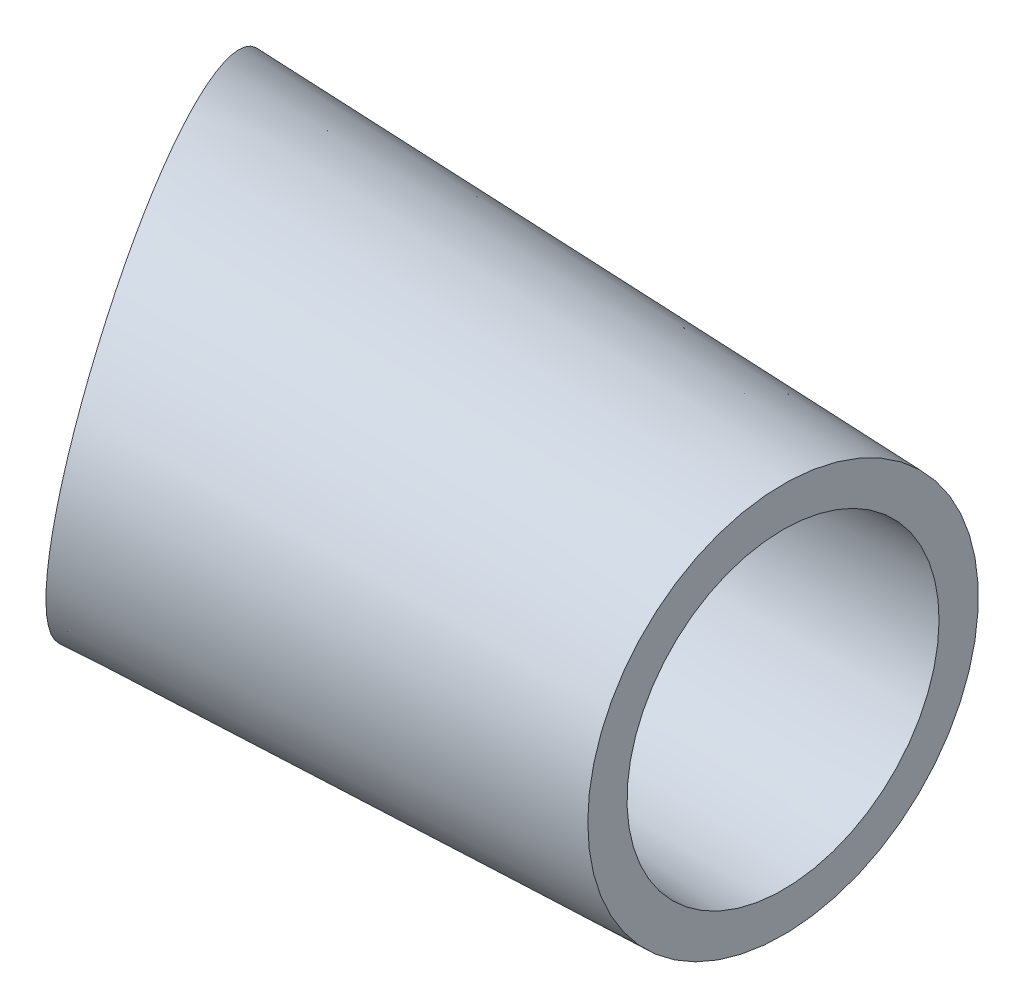
ISO-10303-21;
HEADER;
FILE_DESCRIPTION(('STEP AP214'),'2;1');
FILE_NAME('part.step','',(''),(''),'','','');
FILE_SCHEMA(('AUTOMOTIVE_DESIGN { 1 0 10303 214 1 1 1 1 }'));
ENDSEC;
DATA;
#1=APPLICATION_CONTEXT('core data for automotive mechanical design processes');
#2=APPLICATION_PROTOCOL_DEFINITION('international standard','automotive_design',2000,#1);
#3=PRODUCT_CONTEXT('',#1,'mechanical');
#4=PRODUCT('Part','Part','',(#3));
#5=PRODUCT_RELATED_PRODUCT_CATEGORY('part','',(#4));
#6=PRODUCT_DEFINITION_FORMATION('','',#4);
#7=PRODUCT_DEFINITION_CONTEXT('part definition',#1,'design');
#8=PRODUCT_DEFINITION('design','',#6,#7);
#9=PRODUCT_DEFINITION_SHAPE('','',#8);
#10=(LENGTH_UNIT() NAMED_UNIT(*) SI_UNIT(.MILLI.,.METRE.));
#11=(NAMED_UNIT(*) PLANE_ANGLE_UNIT() SI_UNIT($,.RADIAN.));
#12=(NAMED_UNIT(*) SI_UNIT($,.STERADIAN.) SOLID_ANGLE_UNIT());
#13=UNCERTAINTY_MEASURE_WITH_UNIT(LENGTH_MEASURE(1.E-05),#10,'distance_accuracy_value','');
#14=(GEOMETRIC_REPRESENTATION_CONTEXT(3) GLOBAL_UNCERTAINTY_ASSIGNED_CONTEXT((#13)) GLOBAL_UNIT_ASSIGNED_CONTEXT((#10,
#11,#12)) REPRESENTATION_CONTEXT('',''));
#15=CARTESIAN_POINT('',(0.,0.,0.));
#16=DIRECTION('',(0.,0.,1.));
#17=DIRECTION('',(1.,0.,0.));
#18=AXIS2_PLACEMENT_3D('',#15,#16,#17);
#19=CARTESIAN_POINT('',(-3.32033784135941,95.7593495012203,-0.184037288881903));
#20=CARTESIAN_POINT('',(-3.32023972351497,95.760214114572,-0.122691525921269));
#21=CARTESIAN_POINT('',(-3.32014160567053,95.7610787279237,-0.0613457629606337));
#22=CARTESIAN_POINT('',(-3.31023170338174,95.8484046764461,6.13457629606349));
#23=CARTESIAN_POINT('',(-2.47661605890323,95.9749337579072,9.08435945500562));
#24=CARTESIAN_POINT('',(4.26277069198733E-12,96.1037825269542,10.0000000001944));
#25=CARTESIAN_POINT('',(-3.31685623577,95.5062330008136,-0.183936354268494));
#26=CARTESIAN_POINT('',(-3.3167908238737,95.5068094097147,-0.122624236178996));
#27=CARTESIAN_POINT('',(-3.3167254119774,95.5073858186158,-0.0613121180894974));
#28=CARTESIAN_POINT('',(-3.31011881045102,95.5656031176307,6.13121180894982));
#29=CARTESIAN_POINT('',(-2.47138663452059,95.6499558386048,9.09100481577225));
#30=CARTESIAN_POINT('',(4.26287477539589E-12,95.7358550179695,10.0000000001296));
#31=CARTESIAN_POINT('',(-3.31337463018059,95.2531165004068,-0.183835419655084));
#32=CARTESIAN_POINT('',(-3.31334192423243,95.2534047048574,-0.122556946436723));
#33=CARTESIAN_POINT('',(-3.31330921828427,95.2536929093079,-0.0612784732183612));
#34=CARTESIAN_POINT('',(-3.31000591752029,95.2828015588154,6.12784732183616));
#35=CARTESIAN_POINT('',(-2.46615721013795,95.3249779193024,9.09765017653888));
#36=CARTESIAN_POINT('',(4.26297885880444E-12,95.3679275089847,10.0000000000649));
#37=CARTESIAN_POINT('',(-3.29901300712426,94.2090109362289,-0.18341906437477));
#38=CARTESIAN_POINT('',(-3.29911521321219,94.2081102973209,-0.122279376249847));
#39=CARTESIAN_POINT('',(-3.29921741930012,94.2072096584129,-0.0611396881249241));
#40=CARTESIAN_POINT('',(-3.30954023418106,94.1162451287022,6.11396881249228));
#41=CARTESIAN_POINT('',(-2.44458583455956,93.98444400218,9.12506228970122));
#42=CARTESIAN_POINT('',(4.26340820286475E-12,93.8502265344227,9.99999999979762));
#43=CARTESIAN_POINT('',(-3.29768877126216,92.6266734184361,-0.186237597628298));
#44=CARTESIAN_POINT('',(-3.29792020399182,92.6239932699078,-0.124158398418865));
#45=CARTESIAN_POINT('',(-3.29815163672148,92.6213131213796,-0.0620791992094317));
#46=CARTESIAN_POINT('',(-3.32152634241694,92.3506181200275,6.20791992094334));
#47=CARTESIAN_POINT('',(-2.41952482664806,91.957927997574,9.36453261538096));
#48=CARTESIAN_POINT('',(4.26316425737594E-12,91.5582050316754,10.313090735642));
#49=CARTESIAN_POINT('',(-3.35957448772953,90.2525842129129,-0.196425885249977));
#50=CARTESIAN_POINT('',(-3.35976510287447,90.2477072970523,-0.130950590166652));
#51=CARTESIAN_POINT('',(-3.35995571801942,90.2428303811917,-0.0654752950833268));
#52=CARTESIAN_POINT('',(-3.37920784765884,89.7502618792728,6.54752950833252));
#53=CARTESIAN_POINT('',(-2.40569252875286,89.0037801383462,10.065051511361));
#54=CARTESIAN_POINT('',(4.26327267759319E-12,88.2551653725644,11.3232146909706));
#55=CARTESIAN_POINT('',(-3.48789694750273,87.8798833437328,-0.210046179333926));
#56=CARTESIAN_POINT('',(-3.48780298657084,87.8731973423953,-0.140030786222618));
#57=CARTESIAN_POINT('',(-3.48770902563896,87.8665113410579,-0.0700153931113102));
#58=CARTESIAN_POINT('',(-3.47821897151817,87.1912252059778,7.0015393111308));
#59=CARTESIAN_POINT('',(-2.41650997536182,86.122113444057,10.9614290022923));
#60=CARTESIAN_POINT('',(4.26335399275612E-12,85.0653506856381,12.6440562080894));
#61=CARTESIAN_POINT('',(-3.7493170802311,84.7211682382065,-0.231093606619197));
#62=CARTESIAN_POINT('',(-3.74851262567534,84.7124685048417,-0.154062404412798));
#63=CARTESIAN_POINT('',(-3.74770817111957,84.7037687714769,-0.0770312022063989));
#64=CARTESIAN_POINT('',(-3.66645826098768,83.8250957016303,7.7031202206399));
#65=CARTESIAN_POINT('',(-2.46437823144004,82.3584566862005,12.3206657414968));
#66=CARTESIAN_POINT('',(4.26178189960602E-12,80.9331141395866,14.6660474659493));
#67=CARTESIAN_POINT('',(-4.14883428544006,81.5743967974306,-0.254913355292645));
#68=CARTESIAN_POINT('',(-4.14681367768039,81.5640823883875,-0.169942236861764));
#69=CARTESIAN_POINT('',(-4.14479306992071,81.5537679793444,-0.0849711184308833));
#70=CARTESIAN_POINT('',(-3.94071168619355,80.5120126659906,8.49711184308807));
#71=CARTESIAN_POINT('',(-2.56328198030883,78.6819541971733,13.8365350812361));
#72=CARTESIAN_POINT('',(4.26243242090951E-12,76.9313242773252,16.9378684683057));
#73=CARTESIAN_POINT('',(-4.68295707642726,78.4478025029072,-0.280054343935183));
#74=CARTESIAN_POINT('',(-4.67922812087052,78.4360394499658,-0.186702895956789));
#75=CARTESIAN_POINT('',(-4.67549916531377,78.4242763970243,-0.0933514479783945));
#76=CARTESIAN_POINT('',(-4.29887465408258,77.2362080499361,9.3351447978394));
#77=CARTESIAN_POINT('',(-2.71179646748194,75.0590430997608,15.4259875601082));
#78=CARTESIAN_POINT('',(4.26210716025777E-12,73.00255130138,19.3279693012835));
#79=CARTESIAN_POINT('',(-5.14673963594628,76.1140332129099,-0.299501106901493));
#80=CARTESIAN_POINT('',(-5.14149843725689,76.1012474988851,-0.199667404600996));
#81=CARTESIAN_POINT('',(-5.1362572385675,76.0884617848602,-0.0998337023004997));
#82=CARTESIAN_POINT('',(-4.60689617093905,74.797104668346,9.98337023004968));
#83=CARTESIAN_POINT('',(-2.84645663689108,72.3661585156109,16.6509857151081));
#84=CARTESIAN_POINT('',(4.26145663895428E-12,70.087922534884,21.1734493496429));
#85=CARTESIAN_POINT('',(-5.66960033513341,73.7926606125094,-0.319207371721182));
#86=CARTESIAN_POINT('',(-5.66263102603827,73.7788527315476,-0.212804914480788));
#87=CARTESIAN_POINT('',(-5.65566171694312,73.7650448505858,-0.106402457240395));
#88=CARTESIAN_POINT('',(-4.95176149833334,72.3704488734477,10.6402457240393));
#89=CARTESIAN_POINT('',(-3.00286004520668,69.6874526294797,17.8899295846978));
#90=CARTESIAN_POINT('',(4.26232400069226E-12,67.1886508077457,23.0417873180457));
#91=CARTESIAN_POINT('',(-6.43525565785067,70.7137830284242,-0.344992255778418));
#92=CARTESIAN_POINT('',(-6.42573186793471,70.6984333356769,-0.229994837185612));
#93=CARTESIAN_POINT('',(-6.41620807801876,70.6830836429297,-0.114997418592806));
#94=CARTESIAN_POINT('',(-5.45430529650727,69.1327646754583,11.4997418592806));
#95=CARTESIAN_POINT('',(-3.23661388113566,66.102666797379,19.5124736250272));
#96=CARTESIAN_POINT('',(4.26221558047502E-12,63.2932020151346,25.4874914676674));
#97=CARTESIAN_POINT('',(-7.50153342633092,66.8952690777941,-0.374524402186752));
#98=CARTESIAN_POINT('',(-7.48841745252247,66.8773190281757,-0.249682934791168));
#99=CARTESIAN_POINT('',(-7.47530147871403,66.8593689785573,-0.124841467395585));
#100=CARTESIAN_POINT('',(-6.15058812406101,65.0464139670973,12.4841467395583));
#101=CARTESIAN_POINT('',(-3.56900792193635,61.5366653409081,21.3833928959682));
#102=CARTESIAN_POINT('',(4.26178189960602E-12,58.2736793816245,28.2978871058391));
#103=CARTESIAN_POINT('',(-8.86363666274132,62.3401215379093,-0.404558842889708));
#104=CARTESIAN_POINT('',(-8.84590739735435,62.3180160374998,-0.269705895259806));
#105=CARTESIAN_POINT('',(-8.82817813196738,62.2959105370903,-0.134852947629903));
#106=CARTESIAN_POINT('',(-7.03752232788325,60.0632549957304,13.4852947629902));
#107=CARTESIAN_POINT('',(-3.99846088484188,55.9060414516423,23.3153582527551));
#108=CARTESIAN_POINT('',(4.26221558047502E-12,51.9975856787107,31.1776105577497));
#109=CARTESIAN_POINT('',(-9.97919300632939,58.540308371435,-0.424046298602275));
#110=CARTESIAN_POINT('',(-9.95768882408465,58.5139999864224,-0.282697532401517));
#111=CARTESIAN_POINT('',(-9.93618464183992,58.4876916014099,-0.141348766200758));
#112=CARTESIAN_POINT('',(-7.76426223512187,55.8305447151425,14.1348766200758));
#113=CARTESIAN_POINT('',(-4.3495195011584,51.0813708850248,24.6054585942461));
#114=CARTESIAN_POINT('',(4.26069769743354E-12,46.5619634785758,33.0730196024647));
#115=CARTESIAN_POINT('',(-10.7689861497816,55.4735899432799,-0.435382914505368));
#116=CARTESIAN_POINT('',(-10.744834329219,55.4436077109046,-0.290255276336913));
#117=CARTESIAN_POINT('',(-10.7206825086564,55.4136254785292,-0.145127638168459));
#118=CARTESIAN_POINT('',(-8.28134863183441,52.385420008619,14.5127638168454));
#119=CARTESIAN_POINT('',(-4.59313687737679,47.1400205183786,25.3926490957045));
#120=CARTESIAN_POINT('',(4.26069769743354E-12,42.1006978370791,34.2026787776034));
#121=CARTESIAN_POINT('',(-11.4551823114214,52.3830961194043,-0.443476779985051));
#122=CARTESIAN_POINT('',(-11.4287588425784,52.3492982635544,-0.295651186656701));
#123=CARTESIAN_POINT('',(-11.4023353737355,52.3155004077046,-0.147825593328351));
#124=CARTESIAN_POINT('',(-8.73356502059806,48.9019169668697,14.782559332835));
#125=CARTESIAN_POINT('',(-4.79912916457822,43.1496982976652,25.9933016684416));
#126=CARTESIAN_POINT('',(4.26091453786803E-12,37.5760945758979,35.0376646526285));
#127=CARTESIAN_POINT('',(-12.1055081178511,48.4791458825052,-0.446750483580614));
#128=CARTESIAN_POINT('',(-12.07699835425,48.4403828032049,-0.29783365572041));
#129=CARTESIAN_POINT('',(-12.0484885906488,48.4016197239047,-0.148916827860206));
#130=CARTESIAN_POINT('',(-9.16900246693089,44.4865487145831,14.8916827860204));
#131=CARTESIAN_POINT('',(-4.98119514461128,38.0855142895933,26.3507123663262));
#132=CARTESIAN_POINT('',(4.26134821873703E-12,31.8237842773403,35.459707196775));
#133=CARTESIAN_POINT('',(-12.5360213231124,43.7497341824,-0.436876927798753));
#134=CARTESIAN_POINT('',(-12.5062801413744,43.7052317407423,-0.291251285199171));
#135=CARTESIAN_POINT('',(-12.4765389596364,43.6607292990847,-0.145625642599588));
#136=CARTESIAN_POINT('',(-9.47267960409738,39.1659826916659,14.5625642599583));
#137=CARTESIAN_POINT('',(-5.07214774015747,31.9988994335269,25.9869351945906));
#138=CARTESIAN_POINT('',(4.25961349526105E-12,24.931050597628,34.7128972833208));
#139=CARTESIAN_POINT('',(-12.6212935934464,38.9985715914568,-0.41102705648737));
#140=CARTESIAN_POINT('',(-12.5915779167477,38.9495517914533,-0.274018037658249));
#141=CARTESIAN_POINT('',(-12.561862240049,38.9005319914499,-0.137009018829127));
#142=CARTESIAN_POINT('',(-9.56057889347722,33.9495321911022,13.7009018829121));
#143=CARTESIAN_POINT('',(-5.03693848330505,26.1001875986502,24.7062954566062));
#144=CARTESIAN_POINT('',(4.26091453786803E-12,18.3450335602116,32.5158945216112));
#145=CARTESIAN_POINT('',(-12.3841419226867,34.2455000702239,-0.369503390993638));
#146=CARTESIAN_POINT('',(-12.3556275264852,34.1944133754301,-0.246335593995761));
#147=CARTESIAN_POINT('',(-12.3271131302838,34.1433266806363,-0.123167796997883));
#148=CARTESIAN_POINT('',(-9.4471591139335,28.9835705064628,12.3167796997878));
#149=CARTESIAN_POINT('',(-4.88352563427438,20.6233994174228,22.5272063493302));
#150=CARTESIAN_POINT('',(4.26048085699904E-12,12.4214708252582,28.8969340098351));
#151=CARTESIAN_POINT('',(-11.8581845778124,29.5059742198807,-0.315411089303516));
#152=CARTESIAN_POINT('',(-11.8319269160911,29.4560307106992,-0.210274059535679));
#153=CARTESIAN_POINT('',(-11.8056692543698,29.4060872015178,-0.105137029767843));
#154=CARTESIAN_POINT('',(-9.15364542051688,24.3617927741863,10.5137029767837));
#155=CARTESIAN_POINT('',(-4.62378482897337,15.7157797145001,19.6294449974072));
#156=CARTESIAN_POINT('',(4.26004717613004E-12,7.38243997545722,24.1390359951614));
#157=CARTESIAN_POINT('',(-11.0806195731737,24.7911792432987,-0.252644900952354));
#158=CARTESIAN_POINT('',(-11.0575407955123,24.7456044231843,-0.168429933968238));
#159=CARTESIAN_POINT('',(-11.0344620178509,24.7000296030698,-0.0842149669841222));
#160=CARTESIAN_POINT('',(-8.70350547404954,20.0969727715102,8.42149669841161));
#161=CARTESIAN_POINT('',(-4.27088999612501,11.3895287702404,16.238249857114));
#162=CARTESIAN_POINT('',(4.25874613352306E-12,3.24055466969312,18.5970017747044));
#163=CARTESIAN_POINT('',(-10.4185528817039,21.6691348919108,-0.207079090190809));
#164=CARTESIAN_POINT('',(-10.398121977882,21.6283569833582,-0.138052726793874));
#165=CARTESIAN_POINT('',(-10.3776910740601,21.5875790748056,-0.0690263633969403));
#166=CARTESIAN_POINT('',(-8.31416978805036,17.4690103109952,6.90263633969341));
#167=CARTESIAN_POINT('',(-3.98203460682282,8.84975260740575,13.7678189913936));
#168=CARTESIAN_POINT('',(4.26048085699904E-12,1.00686582638344,14.5673986785919));
#169=CARTESIAN_POINT('',(-10.0569822278478,20.1139644556955,-0.183706863396939));
#170=CARTESIAN_POINT('',(-10.0379881518985,20.075976303797,-0.122471242264628));
#171=CARTESIAN_POINT('',(-10.0189940759493,20.0379881518985,-0.0612356211323165));
#172=CARTESIAN_POINT('',(-8.10059240507301,16.2011848101491,6.12356211323112));
#173=CARTESIAN_POINT('',(-3.82610913475955,7.65221826952447,12.5));
#174=CARTESIAN_POINT('',(4.25961349526105E-12,0.,12.5));
#175=B_SPLINE_SURFACE_WITH_KNOTS('',3,3,((#19,#20,#21,#22,#23,#24),(#25,#26,#27,#28,#29,#30),
(#31,#32,#33,#34,#35,#36),(#37,#38,#39,#40,#41,#42),(#43,#44,#45,#46,#47,#48),(#49,#50,#51,#52,
#53,#54),(#55,#56,#57,#58,#59,#60),(#61,#62,#63,#64,#65,#66),(#67,#68,#69,#70,#71,#72),(#73,#74,
#75,#76,#77,#78),(#79,#80,#81,#82,#83,#84),(#85,#86,#87,#88,#89,#90),(#91,#92,#93,#94,#95,#96),
(#97,#98,#99,#100,#101,#102),(#103,#104,#105,#106,#107,#108),(#109,#110,#111,#112,#113,#114),
(#115,#116,#117,#118,#119,#120),(#121,#122,#123,#124,#125,#126),(#127,#128,#129,#130,#131,#132),
(#133,#134,#135,#136,#137,#138),(#139,#140,#141,#142,#143,#144),(#145,#146,#147,#148,#149,#150),
(#151,#152,#153,#154,#155,#156),(#157,#158,#159,#160,#161,#162),(#163,#164,#165,#166,#167,#168),
(#169,#170,#171,#172,#173,#174)),.UNSPECIFIED.,.F.,.F.,.F.,(4,2,1,1,1,1,1,1,1,1,1,1,1,1,1,1,1,1,
1,1,1,1,4),(4,2,4),(-0.01,0.,0.03125,0.0625,0.09375,0.125,0.1875,0.21875,0.25,0.28125,0.3125,
0.375,0.4375,0.5,0.53125,0.5625,0.625,0.6875,0.75,0.8125,0.875,0.9375,1.),(-0.01,0.,1.),.UNSPECIFIED.);
#176=OFFSET_SURFACE('',#175,-1.,.F.);
#177=CARTESIAN_POINT('',(-1.34638529566944,44.3155755011315,29.1555116497258));
#178=CARTESIAN_POINT('',(-1.4465354121165,44.2007606660017,28.989581409363));
#179=CARTESIAN_POINT('',(-1.54904541566924,44.1044751743858,28.8117064586224));
#180=CARTESIAN_POINT('',(-1.7549039185898,43.9522667666393,28.4394100964137));
#181=CARTESIAN_POINT('',(-1.85825395525615,43.896456577443,28.2449441461297));
#182=CARTESIAN_POINT('',(-2.04872966671729,43.8324142734691,27.8731229791597));
#183=CARTESIAN_POINT('',(-2.13621166602821,43.8189209885129,27.6968493617625));
#184=CARTESIAN_POINT('',(-2.30653317435261,43.825857925678,27.3428780300895));
#185=CARTESIAN_POINT('',(-2.389377995579,43.846248473832,27.165182223413));
#186=CARTESIAN_POINT('',(-2.54560936306189,43.9206687195739,26.819118520454));
#187=CARTESIAN_POINT('',(-2.61920205631472,43.9736942175562,26.6506298998867));
#188=CARTESIAN_POINT('',(-2.75705841875894,44.1126197288856,26.3235639225748));
#189=CARTESIAN_POINT('',(-2.82132533004585,44.19850827949,26.1649831323569));
#190=CARTESIAN_POINT('',(-2.93241233972624,44.3927633461726,25.8781054161317));
#191=CARTESIAN_POINT('',(-2.98028495732457,44.4983925192077,25.7483666317751));
#192=CARTESIAN_POINT('',(-3.06376537529947,44.7336608905451,25.508131477087));
#193=CARTESIAN_POINT('',(-3.09938419064456,44.8632783636439,25.3976178696192));
#194=CARTESIAN_POINT('',(-3.15331264517634,45.1273743944897,25.2117826419738));
#195=CARTESIAN_POINT('',(-3.1730860997234,45.2597820595921,25.1339377558404));
#196=CARTESIAN_POINT('',(-3.2003527140644,45.5366457006801,25.0008207001009));
#197=CARTESIAN_POINT('',(-3.20785274466864,45.6810948880426,24.9455359141009));
#198=CARTESIAN_POINT('',(-3.21003229797414,45.9660234948866,24.8629185555983));
#199=CARTESIAN_POINT('',(-3.20563668847143,46.1059797367059,24.8337912791046));
#200=CARTESIAN_POINT('',(-3.18609346542773,46.3879423498395,24.7973325211571));
#201=CARTESIAN_POINT('',(-3.17094716138985,46.529948469402,24.789998385724));
#202=CARTESIAN_POINT('',(-3.13068242092791,46.8105328802122,24.7967870535172));
#203=CARTESIAN_POINT('',(-3.10566462109807,46.9491312143632,24.8106972639624));
#204=CARTESIAN_POINT('',(-3.04656946847162,47.2208262472084,24.8584420821187));
#205=CARTESIAN_POINT('',(-3.01249049381709,47.353921956056,24.8922802580511));
#206=CARTESIAN_POINT('',(-2.93430754084566,47.6186965301582,24.9805232640828));
#207=CARTESIAN_POINT('',(-2.88975808706411,47.7499020017963,25.0359493674181));
#208=CARTESIAN_POINT('',(-2.79323502230391,48.0002244838933,25.1646499263377));
#209=CARTESIAN_POINT('',(-2.74125876594073,48.1193371609979,25.2379307482573));
#210=CARTESIAN_POINT('',(-2.62589315700218,48.3544289781285,25.4077315330935));
#211=CARTESIAN_POINT('',(-2.5618855958766,48.4689798042125,25.5058174392502));
#212=CARTESIAN_POINT('',(-2.46179449516723,48.6266252347687,25.6641987264046));
#213=CARTESIAN_POINT('',(-2.42773713479154,48.6768266003087,25.7188907878474));
#214=CARTESIAN_POINT('',(-2.358419816383,48.7724123825925,25.8317050382074));
#215=CARTESIAN_POINT('',(-2.3231590015531,48.8177932687237,25.8898296933996));
#216=CARTESIAN_POINT('',(-2.20823580725342,48.9556024782042,26.0815136541586));
#217=CARTESIAN_POINT('',(-2.12660667107005,49.0383109611928,26.2210353654468));
#218=CARTESIAN_POINT('',(-1.96056091785451,49.1779165366318,26.5109443640531));
#219=CARTESIAN_POINT('',(-1.87614289230237,49.2348003658373,26.661337188791));
#220=CARTESIAN_POINT('',(-1.74551117682775,49.3018715263175,26.8984797845266));
#221=CARTESIAN_POINT('',(-1.69953133903523,49.3215103982203,26.9827864145765));
#222=CARTESIAN_POINT('',(-1.60771174314842,49.3528405834087,27.1528283670802));
#223=CARTESIAN_POINT('',(-1.56187189344877,49.3645394331215,27.2385622553919));
#224=CARTESIAN_POINT('',(-1.42492738368018,49.3875795022212,27.4972839782879));
#225=CARTESIAN_POINT('',(-1.33439482262334,49.3868657464839,27.6717972056511));
#226=CARTESIAN_POINT('',(-1.15639989747605,49.3520067899498,28.0227764078841));
#227=CARTESIAN_POINT('',(-1.06901088714405,49.317320981995,28.1992283059881));
#228=CARTESIAN_POINT('',(-0.94411531674211,49.239200408001,28.4588574902964));
#229=CARTESIAN_POINT('',(-0.903493534485064,49.2087869432743,28.5446062382591));
#230=CARTESIAN_POINT('',(-0.824790117935493,49.1392122640523,28.713664818325));
#231=CARTESIAN_POINT('',(-0.786707015616918,49.1000561630975,28.7969760440405));
#232=CARTESIAN_POINT('',(-0.716306818314014,49.0162482731223,28.9542609025851));
#233=CARTESIAN_POINT('',(-0.683771567504816,48.9722188769611,29.0284689613326));
#234=CARTESIAN_POINT('',(-0.621771639345025,48.87680253117,29.1732980543214));
#235=CARTESIAN_POINT('',(-0.59230505052331,48.8254202096184,29.2439213073145));
#236=CARTESIAN_POINT('',(-0.536890641475956,48.7155140659258,29.3807793975007));
#237=CARTESIAN_POINT('',(-0.510940259153804,48.6569955033529,29.4470174118192));
#238=CARTESIAN_POINT('',(-0.462978769442422,48.5331144887952,29.5743188100954));
#239=CARTESIAN_POINT('',(-0.440966914924745,48.4677533385684,29.6353831743213));
#240=CARTESIAN_POINT('',(-0.404052738719056,48.3402056355667,29.7434155282292));
#241=CARTESIAN_POINT('',(-0.388587495318023,48.2788404701855,29.7911631251661));
#242=CARTESIAN_POINT('',(-0.361112608278354,48.1518091329266,29.8816647292222));
#243=CARTESIAN_POINT('',(-0.349102410157967,48.0861436532623,29.9244195369524));
#244=CARTESIAN_POINT('',(-0.328729345890493,47.9510592476366,30.0044183662989));
#245=CARTESIAN_POINT('',(-0.320363988438825,47.8816429220286,30.0416661405161));
#246=CARTESIAN_POINT('',(-0.307396998311577,47.7396144666055,30.1102507812577));
#247=CARTESIAN_POINT('',(-0.302795036394146,47.6670026169376,30.14158816467));
#248=CARTESIAN_POINT('',(-0.297723816177089,47.5277250942955,30.1947665193406));
#249=CARTESIAN_POINT('',(-0.296841223376981,47.4613321860646,30.2172843444985));
#250=CARTESIAN_POINT('',(-0.298063613779162,47.3270564809849,30.2572454796125));
#251=CARTESIAN_POINT('',(-0.300169538654766,47.259173221167,30.2746871880116));
#252=CARTESIAN_POINT('',(-0.310914885138956,47.0541333239012,30.3191775821395));
#253=CARTESIAN_POINT('',(-0.32397608712901,46.9154214920074,30.3384543401841));
#254=CARTESIAN_POINT('',(-0.36068834125607,46.6410895712825,30.3558674107071));
#255=CARTESIAN_POINT('',(-0.384114219448028,46.5054650076653,30.3544337420244));
#256=CARTESIAN_POINT('',(-0.426198466196689,46.3048281282517,30.337862771329));
#257=CARTESIAN_POINT('',(-0.441389237781406,46.2383980014453,30.3299315498555));
#258=CARTESIAN_POINT('',(-0.473932170550685,46.1067524998502,30.3094176612601));
#259=CARTESIAN_POINT('',(-0.491285698880511,46.0415379236935,30.2968320419606));
#260=CARTESIAN_POINT('',(-0.548723897017184,45.8398649497262,30.2504095112224));
#261=CARTESIAN_POINT('',(-0.592339835050283,45.7061559825659,30.2086275601822));
#262=CARTESIAN_POINT('',(-0.686900384669092,45.4486844444275,30.1067097817484));
#263=CARTESIAN_POINT('',(-0.737850297105143,45.3249291695053,30.0465606433497));
#264=CARTESIAN_POINT('',(-0.821574284708666,45.141717992553,29.9404116934227));
#265=CARTESIAN_POINT('',(-0.852395364097462,45.0780744467928,29.8999566795068));
#266=CARTESIAN_POINT('',(-0.915528152249458,44.9548378871878,29.8144633570083));
#267=CARTESIAN_POINT('',(-0.947838568162507,44.8952414673119,29.7694289841484));
#268=CARTESIAN_POINT('',(-1.04664513655358,44.7229047960106,29.6280061460911));
#269=CARTESIAN_POINT('',(-1.11511275208752,44.6164083828587,29.5251757039736));
#270=CARTESIAN_POINT('',(-1.21163962857108,44.4826515486896,29.3739924210345));
#271=CARTESIAN_POINT('',(-1.23831030878563,44.4473480212629,29.3315930066486));
#272=CARTESIAN_POINT('',(-1.2920574821367,44.3794306322683,29.2449278964437));
#273=CARTESIAN_POINT('',(-1.31913402504033,44.3468171037912,29.2006619705252));
#274=CARTESIAN_POINT('',(-1.34638529566944,44.3155755011315,29.1555116497258));
#275=B_SPLINE_CURVE_WITH_KNOTS('',3,(#177,#178,#179,#180,#181,#182,#183,#184,#185,#186,#187,
#188,#189,#190,#191,#192,#193,#194,#195,#196,#197,#198,#199,#200,#201,#202,#203,#204,#205,#206,
#207,#208,#209,#210,#211,#212,#213,#214,#215,#216,#217,#218,#219,#220,#221,#222,#223,#224,#225,
#226,#227,#228,#229,#230,#231,#232,#233,#234,#235,#236,#237,#238,#239,#240,#241,#242,#243,#244,
#245,#246,#247,#248,#249,#250,#251,#252,#253,#254,#255,#256,#257,#258,#259,#260,#261,#262,#263,
#264,#265,#266,#267,#268,#269,#270,#271,#272,#273,#274),.UNSPECIFIED.,.T.,.F.,(4,2,2,2,2,2,2,2,
2,2,2,2,2,2,2,2,2,2,2,2,2,2,2,2,2,2,2,2,2,2,2,2,2,2,2,2,2,2,2,2,2,2,2,2,2,2,2,2,4),(0.,
0.675500517379337,1.35287520726594,1.94179723526872,2.53003019087385,3.10100989553835,
3.67179062186161,4.19092111960861,4.70958374304031,5.17169571051667,5.6335488935498,
6.06054514180285,6.48748938811483,6.91018909842374,7.33296451866288,7.77880370590171,
8.22480209622008,8.7141239814758,8.95897083654681,9.20399580333458,9.74629959613426,
10.2888815957025,10.5826345053599,10.8761082023091,11.4630370038963,12.0594600864061,
12.3580099831295,12.6563857142777,12.9326474819323,13.208736123536,13.4846224977203,
13.7604564813657,13.9979529690977,14.2354113209978,14.4727071108709,14.7099821386251,
14.9200527299473,15.1301895286074,15.5499401089416,15.9609879956267,16.166624723144,
16.3723921056459,16.8106292115045,17.2491846718651,17.4933621611079,17.7373315382198,
18.2244970076848,18.4082808348305,18.5920873850599),.UNSPECIFIED.);
#276=CARTESIAN_POINT('',(-1.34638529566944,44.3155755011315,29.1555116497258));
#277=VERTEX_POINT('',#276);
#278=EDGE_CURVE('E54',#277,#277,#275,.T.);
#279=ORIENTED_EDGE('',*,*,#278,.F.);
#280=EDGE_LOOP('',(#279));
#281=FACE_BOUND('',#280,.T.);
#282=ADVANCED_FACE('F31',(#281),#176,.T.);
#283=CARTESIAN_POINT('',(-0.142653402285345,46.6166559443316,27.6214580209257));
#284=DIRECTION('',(-1.,0.,0.));
#285=DIRECTION('',(0.,-0.832050294337844,0.554700196225229));
#286=AXIS2_PLACEMENT_3D('',#283,#284,#285);
#287=PLANE('',#286);
#288=CARTESIAN_POINT('',(-0.142653402285345,46.6166559443316,27.6214580209257));
#289=DIRECTION('',(-1.,0.,0.));
#290=DIRECTION('',(0.,0.832050294337844,-0.554700196225229));
#291=AXIS2_PLACEMENT_3D('',#288,#289,#290);
#292=CIRCLE('',#291,1.);
#293=CARTESIAN_POINT('',(-0.142653402285347,47.4487062386695,27.0667578247005));
#294=VERTEX_POINT('',#293);
#295=EDGE_CURVE('E44',#294,#294,#292,.T.);
#296=ORIENTED_EDGE('',*,*,#295,.F.);
#297=EDGE_LOOP('',(#296));
#298=FACE_BOUND('',#297,.T.);
#299=ADVANCED_FACE('F79',(#298),#287,.F.);
#300=CARTESIAN_POINT('',(3.25734659771465,46.6166559443316,27.6214580209257));
#301=DIRECTION('',(-1.,0.,0.));
#302=DIRECTION('',(0.,-0.832050294337844,0.554700196225229));
#303=AXIS2_PLACEMENT_3D('',#300,#301,#302);
#304=CYLINDRICAL_SURFACE('',#303,1.);
#305=ORIENTED_EDGE('',*,*,#295,.T.);
#306=EDGE_LOOP('',(#305));
#307=FACE_BOUND('',#306,.T.);
#308=CARTESIAN_POINT('',(3.25734659771465,46.6166559443316,27.6214580209257));
#309=DIRECTION('',(1.,0.,0.));
#310=DIRECTION('',(0.,-0.832050294337844,0.554700196225229));
#311=AXIS2_PLACEMENT_3D('',#308,#309,#310);
#312=CIRCLE('',#311,1.);
#313=CARTESIAN_POINT('',(3.25734659771466,45.7846056499938,28.176158217151));
#314=VERTEX_POINT('',#313);
#315=EDGE_CURVE('E40',#314,#314,#312,.F.);
#316=ORIENTED_EDGE('',*,*,#315,.F.);
#317=EDGE_LOOP('',(#316));
#318=FACE_BOUND('',#317,.T.);
#319=ADVANCED_FACE('F75',(#307,#318),#304,.F.);
#320=CARTESIAN_POINT('',(3.25734659771465,46.6166559443316,27.6214580209257));
#321=DIRECTION('',(-1.,0.,0.));
#322=DIRECTION('',(0.,-0.832050294337844,0.554700196225229));
#323=AXIS2_PLACEMENT_3D('',#320,#321,#322);
#324=PLANE('',#323);
#325=ORIENTED_EDGE('',*,*,#315,.T.);
#326=EDGE_LOOP('',(#325));
#327=FACE_BOUND('',#326,.T.);
#328=CARTESIAN_POINT('',(3.25734659771465,46.6166559443316,27.6214580209257));
#329=DIRECTION('',(-1.,0.,0.));
#330=DIRECTION('',(0.,0.832050294337844,-0.554700196225229));
#331=AXIS2_PLACEMENT_3D('',#328,#329,#330);
#332=CIRCLE('',#331,1.91882364313552);
#333=CARTESIAN_POINT('',(3.25734659771465,48.2132137213849,26.5570861695569));
#334=VERTEX_POINT('',#333);
#335=EDGE_CURVE('E10',#334,#334,#332,.T.);
#336=ORIENTED_EDGE('',*,*,#335,.F.);
#337=EDGE_LOOP('',(#336));
#338=FACE_BOUND('',#337,.T.);
#339=ADVANCED_FACE('F78',(#327,#338),#324,.F.);
#340=CARTESIAN_POINT('',(3.25734659771465,46.6166559443316,27.6214580209257));
#341=DIRECTION('',(1.,0.,0.));
#342=DIRECTION('',(0.,0.832050294337844,-0.554700196225229));
#343=AXIS2_PLACEMENT_3D('',#340,#341,#342);
#344=CONICAL_SURFACE('',#343,1.91882364313552,0.0261799387799149);
#345=CARTESIAN_POINT('',(6.25734659771464,46.6166559443316,27.6214580209257));
#346=DIRECTION('',(1.,0.,0.));
#347=DIRECTION('',(0.,1.,0.));
#348=AXIS2_PLACEMENT_3D('',#345,#346,#347);
#349=CIRCLE('',#348,1.99738140784308);
#350=CARTESIAN_POINT('',(6.25734659771464,48.6140373521747,27.6214580209257));
#351=VERTEX_POINT('',#350);
#352=EDGE_CURVE('E48',#351,#351,#349,.T.);
#353=ORIENTED_EDGE('',*,*,#352,.T.);
#354=EDGE_LOOP('',(#353));
#355=FACE_BOUND('',#354,.T.);
#356=ORIENTED_EDGE('',*,*,#335,.T.);
#357=EDGE_LOOP('',(#356));
#358=FACE_BOUND('',#357,.T.);
#359=ADVANCED_FACE('F73',(#355,#358),#344,.F.);
#360=CARTESIAN_POINT('',(6.25734659771464,46.6166559443316,27.6214580209257));
#361=DIRECTION('',(1.,0.,0.));
#362=DIRECTION('',(0.,0.832050294337844,-0.554700196225229));
#363=AXIS2_PLACEMENT_3D('',#360,#361,#362);
#364=PLANE('',#363);
#365=ORIENTED_EDGE('',*,*,#352,.F.);
#366=EDGE_LOOP('',(#365));
#367=FACE_BOUND('',#366,.T.);
#368=CARTESIAN_POINT('',(6.25734659771464,46.6166559443316,27.6214580209257));
#369=DIRECTION('',(1.,0.,0.));
#370=DIRECTION('',(0.,-0.832050294337844,0.554700196225229));
#371=AXIS2_PLACEMENT_3D('',#368,#369,#370);
#372=CIRCLE('',#371,2.5);
#373=CARTESIAN_POINT('',(6.25734659771464,44.536530208487,29.0082085114888));
#374=VERTEX_POINT('',#373);
#375=EDGE_CURVE('E51',#374,#374,#372,.T.);
#376=ORIENTED_EDGE('',*,*,#375,.T.);
#377=EDGE_LOOP('',(#376));
#378=FACE_BOUND('',#377,.T.);
#379=ADVANCED_FACE('F69',(#367,#378),#364,.T.);
#380=CARTESIAN_POINT('',(6.25734659771464,46.6166559443316,27.6214580209257));
#381=DIRECTION('',(-1.,0.,0.));
#382=DIRECTION('',(0.,-0.832050294337844,0.554700196225229));
#383=AXIS2_PLACEMENT_3D('',#380,#381,#382);
#384=CONICAL_SURFACE('',#383,2.5,0.0349100449415003);
#385=ORIENTED_EDGE('',*,*,#278,.T.);
#386=EDGE_LOOP('',(#385));
#387=FACE_BOUND('',#386,.T.);
#388=ORIENTED_EDGE('',*,*,#375,.F.);
#389=EDGE_LOOP('',(#388));
#390=FACE_BOUND('',#389,.T.);
#391=ADVANCED_FACE('F65',(#387,#390),#384,.T.);
#392=CLOSED_SHELL('',(#282,#299,#319,#339,#359,#379,#391));
#393=MANIFOLD_SOLID_BREP('B2',#392);
#394=ADVANCED_BREP_SHAPE_REPRESENTATION('',(#18,#393),#14);
#395=SHAPE_DEFINITION_REPRESENTATION(#9,#394);
ENDSEC;
END-ISO-10303-21;
